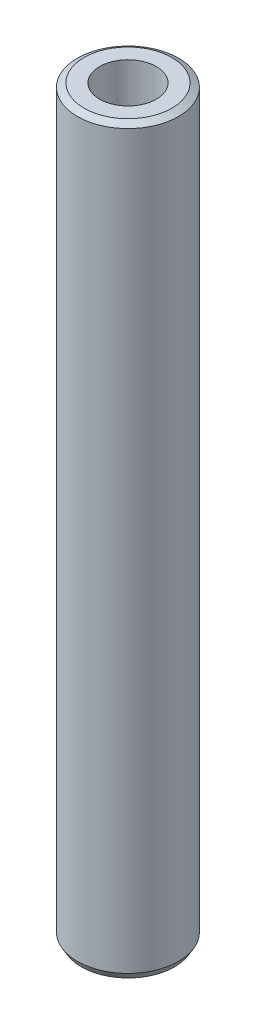
ISO-10303-21;
HEADER;
FILE_DESCRIPTION(('STEP AP214'),'2;1');
FILE_NAME('part.step','',(''),(''),'','','');
FILE_SCHEMA(('AUTOMOTIVE_DESIGN { 1 0 10303 214 1 1 1 1 }'));
ENDSEC;
DATA;
#1=APPLICATION_CONTEXT('core data for automotive mechanical design processes');
#2=APPLICATION_PROTOCOL_DEFINITION('international standard','automotive_design',2000,#1);
#3=PRODUCT_CONTEXT('',#1,'mechanical');
#4=PRODUCT('Part','Part','',(#3));
#5=PRODUCT_RELATED_PRODUCT_CATEGORY('part','',(#4));
#6=PRODUCT_DEFINITION_FORMATION('','',#4);
#7=PRODUCT_DEFINITION_CONTEXT('part definition',#1,'design');
#8=PRODUCT_DEFINITION('design','',#6,#7);
#9=PRODUCT_DEFINITION_SHAPE('','',#8);
#10=(LENGTH_UNIT() NAMED_UNIT(*) SI_UNIT(.MILLI.,.METRE.));
#11=(NAMED_UNIT(*) PLANE_ANGLE_UNIT() SI_UNIT($,.RADIAN.));
#12=(NAMED_UNIT(*) SI_UNIT($,.STERADIAN.) SOLID_ANGLE_UNIT());
#13=UNCERTAINTY_MEASURE_WITH_UNIT(LENGTH_MEASURE(1.E-05),#10,'distance_accuracy_value','');
#14=(GEOMETRIC_REPRESENTATION_CONTEXT(3) GLOBAL_UNCERTAINTY_ASSIGNED_CONTEXT((#13)) GLOBAL_UNIT_ASSIGNED_CONTEXT((#10,
#11,#12)) REPRESENTATION_CONTEXT('',''));
#15=CARTESIAN_POINT('',(0.,0.,0.));
#16=DIRECTION('',(0.,0.,1.));
#17=DIRECTION('',(1.,0.,0.));
#18=AXIS2_PLACEMENT_3D('',#15,#16,#17);
#19=CARTESIAN_POINT('',(0.,403.432877806521,0.));
#20=DIRECTION('',(0.,-1.,0.));
#21=DIRECTION('',(0.,0.,-1.));
#22=AXIS2_PLACEMENT_3D('',#19,#20,#21);
#23=CYLINDRICAL_SURFACE('',#22,27.5);
#24=CARTESIAN_POINT('',(0.,401.341016958348,0.));
#25=DIRECTION('',(0.,1.,0.));
#26=DIRECTION('',(0.,0.,1.));
#27=AXIS2_PLACEMENT_3D('',#24,#25,#26);
#28=CIRCLE('',#27,27.5);
#29=CARTESIAN_POINT('',(0.,401.341016958348,27.5));
#30=VERTEX_POINT('',#29);
#31=EDGE_CURVE('E50',#30,#30,#28,.F.);
#32=ORIENTED_EDGE('',*,*,#31,.T.);
#33=EDGE_LOOP('',(#32));
#34=FACE_BOUND('',#33,.T.);
#35=CARTESIAN_POINT('',(0.,3.62320927139975,0.));
#36=DIRECTION('',(0.,1.,0.));
#37=DIRECTION('',(0.,0.,1.));
#38=AXIS2_PLACEMENT_3D('',#35,#36,#37);
#39=CIRCLE('',#38,27.5);
#40=CARTESIAN_POINT('',(0.,3.62320927139975,27.5));
#41=VERTEX_POINT('',#40);
#42=EDGE_CURVE('E51',#41,#41,#39,.T.);
#43=ORIENTED_EDGE('',*,*,#42,.T.);
#44=EDGE_LOOP('',(#43));
#45=FACE_BOUND('',#44,.T.);
#46=ADVANCED_FACE('F39',(#34,#45),#23,.T.);
#47=CARTESIAN_POINT('',(0.,403.432877806521,0.));
#48=DIRECTION('',(0.,1.,0.));
#49=DIRECTION('',(0.,0.,1.));
#50=AXIS2_PLACEMENT_3D('',#47,#48,#49);
#51=PLANE('',#50);
#52=CARTESIAN_POINT('',(0.,403.432877806521,0.));
#53=DIRECTION('',(0.,1.,0.));
#54=DIRECTION('',(0.,0.,1.));
#55=AXIS2_PLACEMENT_3D('',#52,#53,#54);
#56=CIRCLE('',#55,23.8767907286004);
#57=CARTESIAN_POINT('',(0.,403.432877806521,23.8767907286004));
#58=VERTEX_POINT('',#57);
#59=EDGE_CURVE('E54',#58,#58,#56,.T.);
#60=ORIENTED_EDGE('',*,*,#59,.T.);
#61=EDGE_LOOP('',(#60));
#62=FACE_BOUND('',#61,.T.);
#63=CARTESIAN_POINT('',(0.,403.432877806521,0.));
#64=DIRECTION('',(0.,1.,0.));
#65=DIRECTION('',(0.,0.,1.));
#66=AXIS2_PLACEMENT_3D('',#63,#64,#65);
#67=CIRCLE('',#66,15.4089743117396);
#68=CARTESIAN_POINT('',(0.,403.432877806521,15.4089743117396));
#69=VERTEX_POINT('',#68);
#70=EDGE_CURVE('E58',#69,#69,#67,.T.);
#71=ORIENTED_EDGE('',*,*,#70,.F.);
#72=EDGE_LOOP('',(#71));
#73=FACE_BOUND('',#72,.T.);
#74=ADVANCED_FACE('F69',(#62,#73),#51,.T.);
#75=CARTESIAN_POINT('',(0.,0.,0.));
#76=DIRECTION('',(0.,1.,0.));
#77=DIRECTION('',(0.,0.,1.));
#78=AXIS2_PLACEMENT_3D('',#75,#76,#77);
#79=PLANE('',#78);
#80=CARTESIAN_POINT('',(0.,0.,0.));
#81=DIRECTION('',(0.,1.,0.));
#82=DIRECTION('',(0.,0.,1.));
#83=AXIS2_PLACEMENT_3D('',#80,#81,#82);
#84=CIRCLE('',#83,25.408139151827);
#85=CARTESIAN_POINT('',(0.,0.,25.408139151827));
#86=VERTEX_POINT('',#85);
#87=EDGE_CURVE('E10',#86,#86,#84,.F.);
#88=ORIENTED_EDGE('',*,*,#87,.T.);
#89=EDGE_LOOP('',(#88));
#90=FACE_BOUND('',#89,.T.);
#91=CARTESIAN_POINT('',(0.,0.,0.));
#92=DIRECTION('',(0.,1.,0.));
#93=DIRECTION('',(0.,0.,1.));
#94=AXIS2_PLACEMENT_3D('',#91,#92,#93);
#95=CIRCLE('',#94,15.4089743117396);
#96=CARTESIAN_POINT('',(0.,0.,15.4089743117396));
#97=VERTEX_POINT('',#96);
#98=EDGE_CURVE('E63',#97,#97,#95,.T.);
#99=ORIENTED_EDGE('',*,*,#98,.T.);
#100=EDGE_LOOP('',(#99));
#101=FACE_BOUND('',#100,.T.);
#102=ADVANCED_FACE('F75',(#90,#101),#79,.F.);
#103=CARTESIAN_POINT('',(0.,403.432877806521,0.));
#104=DIRECTION('',(0.,-1.,0.));
#105=DIRECTION('',(0.,0.,-1.));
#106=AXIS2_PLACEMENT_3D('',#103,#104,#105);
#107=CYLINDRICAL_SURFACE('',#106,15.4089743117396);
#108=ORIENTED_EDGE('',*,*,#70,.T.);
#109=EDGE_LOOP('',(#108));
#110=FACE_BOUND('',#109,.T.);
#111=ORIENTED_EDGE('',*,*,#98,.F.);
#112=EDGE_LOOP('',(#111));
#113=FACE_BOUND('',#112,.T.);
#114=ADVANCED_FACE('F70',(#110,#113),#107,.F.);
#115=CARTESIAN_POINT('',(0.,403.432877806521,0.));
#116=DIRECTION('',(0.,-1.,0.));
#117=DIRECTION('',(0.,0.,-1.));
#118=AXIS2_PLACEMENT_3D('',#115,#116,#117);
#119=CONICAL_SURFACE('',#118,23.8767907286004,1.04719755119659);
#120=ORIENTED_EDGE('',*,*,#31,.F.);
#121=EDGE_LOOP('',(#120));
#122=FACE_BOUND('',#121,.T.);
#123=ORIENTED_EDGE('',*,*,#59,.F.);
#124=EDGE_LOOP('',(#123));
#125=FACE_BOUND('',#124,.T.);
#126=ADVANCED_FACE('F81',(#122,#125),#119,.T.);
#127=CARTESIAN_POINT('',(0.,3.62320927139975,0.));
#128=DIRECTION('',(0.,1.,0.));
#129=DIRECTION('',(0.,0.,1.));
#130=AXIS2_PLACEMENT_3D('',#127,#128,#129);
#131=CONICAL_SURFACE('',#130,27.5,0.523598775598302);
#132=ORIENTED_EDGE('',*,*,#87,.F.);
#133=EDGE_LOOP('',(#132));
#134=FACE_BOUND('',#133,.T.);
#135=ORIENTED_EDGE('',*,*,#42,.F.);
#136=EDGE_LOOP('',(#135));
#137=FACE_BOUND('',#136,.T.);
#138=ADVANCED_FACE('F45',(#134,#137),#131,.T.);
#139=CLOSED_SHELL('',(#46,#74,#102,#114,#126,#138));
#140=MANIFOLD_SOLID_BREP('B2',#139);
#141=ADVANCED_BREP_SHAPE_REPRESENTATION('',(#18,#140),#14);
#142=SHAPE_DEFINITION_REPRESENTATION(#9,#141);
ENDSEC;
END-ISO-10303-21;
